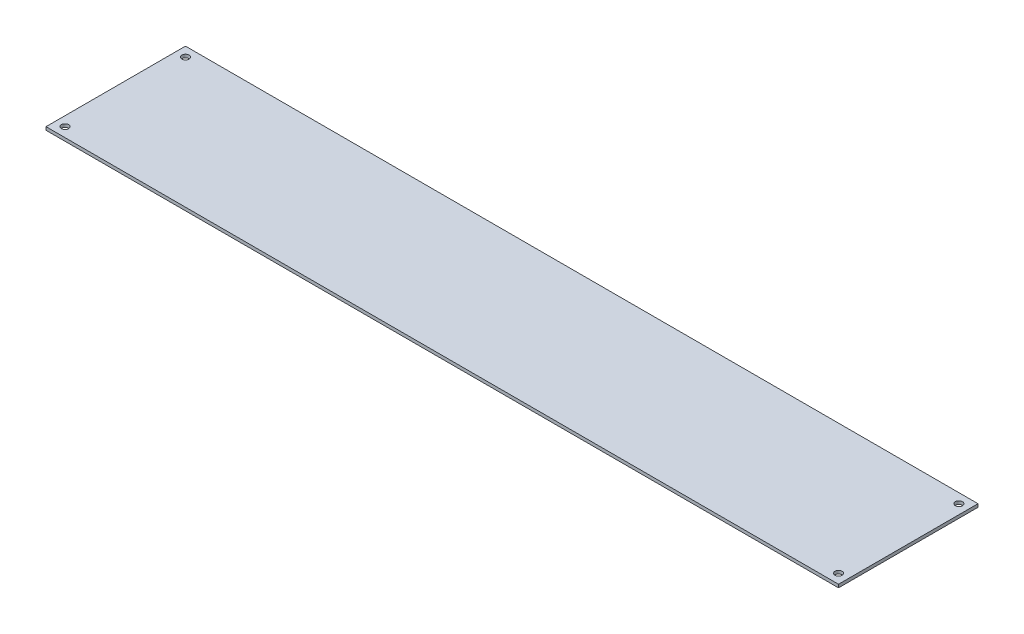
ISO-10303-21;
HEADER;
FILE_DESCRIPTION(('STEP AP214'),'2;1');
FILE_NAME('part.step','',(''),(''),'','','');
FILE_SCHEMA(('AUTOMOTIVE_DESIGN { 1 0 10303 214 1 1 1 1 }'));
ENDSEC;
DATA;
#1=APPLICATION_CONTEXT('core data for automotive mechanical design processes');
#2=APPLICATION_PROTOCOL_DEFINITION('international standard','automotive_design',2000,#1);
#3=PRODUCT_CONTEXT('',#1,'mechanical');
#4=PRODUCT('Part','Part','',(#3));
#5=PRODUCT_RELATED_PRODUCT_CATEGORY('part','',(#4));
#6=PRODUCT_DEFINITION_FORMATION('','',#4);
#7=PRODUCT_DEFINITION_CONTEXT('part definition',#1,'design');
#8=PRODUCT_DEFINITION('design','',#6,#7);
#9=PRODUCT_DEFINITION_SHAPE('','',#8);
#10=(LENGTH_UNIT() NAMED_UNIT(*) SI_UNIT(.MILLI.,.METRE.));
#11=(NAMED_UNIT(*) PLANE_ANGLE_UNIT() SI_UNIT($,.RADIAN.));
#12=(NAMED_UNIT(*) SI_UNIT($,.STERADIAN.) SOLID_ANGLE_UNIT());
#13=UNCERTAINTY_MEASURE_WITH_UNIT(LENGTH_MEASURE(1.E-05),#10,'distance_accuracy_value','');
#14=(GEOMETRIC_REPRESENTATION_CONTEXT(3) GLOBAL_UNCERTAINTY_ASSIGNED_CONTEXT((#13)) GLOBAL_UNIT_ASSIGNED_CONTEXT((#10,
#11,#12)) REPRESENTATION_CONTEXT('',''));
#15=CARTESIAN_POINT('',(0.,0.,0.));
#16=DIRECTION('',(0.,0.,1.));
#17=DIRECTION('',(1.,0.,0.));
#18=AXIS2_PLACEMENT_3D('',#15,#16,#17);
#19=CARTESIAN_POINT('',(0.,2.,0.));
#20=DIRECTION('',(0.,-1.,0.));
#21=DIRECTION('',(0.,0.,-1.));
#22=AXIS2_PLACEMENT_3D('',#19,#20,#21);
#23=PLANE('',#22);
#24=CARTESIAN_POINT('',(494.,2.,-6.));
#25=DIRECTION('',(0.,1.,0.));
#26=DIRECTION('',(0.,0.,1.));
#27=AXIS2_PLACEMENT_3D('',#24,#25,#26);
#28=CIRCLE('',#27,2.24999999999997);
#29=CARTESIAN_POINT('',(494.,2.,-3.75000000000003));
#30=VERTEX_POINT('',#29);
#31=EDGE_CURVE('E118',#30,#30,#28,.T.);
#32=ORIENTED_EDGE('',*,*,#31,.F.);
#33=EDGE_LOOP('',(#32));
#34=FACE_BOUND('',#33,.T.);
#35=DIRECTION('',(0.,0.,1.));
#36=VECTOR('',#35,1.);
#37=CARTESIAN_POINT('',(0.,2.,0.));
#38=LINE('',#37,#36);
#39=CARTESIAN_POINT('',(0.,2.,-88.));
#40=VERTEX_POINT('',#39);
#41=CARTESIAN_POINT('',(0.,2.,0.));
#42=VERTEX_POINT('',#41);
#43=EDGE_CURVE('E84',#40,#42,#38,.T.);
#44=ORIENTED_EDGE('',*,*,#43,.T.);
#45=DIRECTION('',(1.,0.,0.));
#46=VECTOR('',#45,1.);
#47=CARTESIAN_POINT('',(0.,2.,0.));
#48=LINE('',#47,#46);
#49=CARTESIAN_POINT('',(500.,2.,0.));
#50=VERTEX_POINT('',#49);
#51=EDGE_CURVE('E79',#42,#50,#48,.T.);
#52=ORIENTED_EDGE('',*,*,#51,.T.);
#53=DIRECTION('',(0.,0.,-1.));
#54=VECTOR('',#53,1.);
#55=CARTESIAN_POINT('',(500.,2.,0.));
#56=LINE('',#55,#54);
#57=CARTESIAN_POINT('',(500.,2.,-88.));
#58=VERTEX_POINT('',#57);
#59=EDGE_CURVE('E82',#50,#58,#56,.T.);
#60=ORIENTED_EDGE('',*,*,#59,.T.);
#61=DIRECTION('',(-1.,0.,0.));
#62=VECTOR('',#61,1.);
#63=CARTESIAN_POINT('',(0.,2.,-88.));
#64=LINE('',#63,#62);
#65=EDGE_CURVE('E49',#58,#40,#64,.T.);
#66=ORIENTED_EDGE('',*,*,#65,.T.);
#67=EDGE_LOOP('',(#44,#52,#60,#66));
#68=FACE_BOUND('',#67,.T.);
#69=CARTESIAN_POINT('',(494.,2.,-82.));
#70=DIRECTION('',(0.,1.,0.));
#71=DIRECTION('',(0.,0.,1.));
#72=AXIS2_PLACEMENT_3D('',#69,#70,#71);
#73=CIRCLE('',#72,2.24999999999997);
#74=CARTESIAN_POINT('',(494.,2.,-79.75));
#75=VERTEX_POINT('',#74);
#76=EDGE_CURVE('E112',#75,#75,#73,.T.);
#77=ORIENTED_EDGE('',*,*,#76,.F.);
#78=EDGE_LOOP('',(#77));
#79=FACE_BOUND('',#78,.T.);
#80=CARTESIAN_POINT('',(6.00000000000001,2.,-6.));
#81=DIRECTION('',(0.,1.,0.));
#82=DIRECTION('',(0.,0.,1.));
#83=AXIS2_PLACEMENT_3D('',#80,#81,#82);
#84=CIRCLE('',#83,2.24999999999999);
#85=CARTESIAN_POINT('',(6.00000000000001,2.,-3.75000000000001));
#86=VERTEX_POINT('',#85);
#87=EDGE_CURVE('E124',#86,#86,#84,.T.);
#88=ORIENTED_EDGE('',*,*,#87,.F.);
#89=EDGE_LOOP('',(#88));
#90=FACE_BOUND('',#89,.T.);
#91=CARTESIAN_POINT('',(6.00000000000001,2.,-82.));
#92=DIRECTION('',(0.,1.,0.));
#93=DIRECTION('',(0.,0.,1.));
#94=AXIS2_PLACEMENT_3D('',#91,#92,#93);
#95=CIRCLE('',#94,2.24999999999999);
#96=CARTESIAN_POINT('',(6.00000000000001,2.,-79.75));
#97=VERTEX_POINT('',#96);
#98=EDGE_CURVE('E130',#97,#97,#95,.T.);
#99=ORIENTED_EDGE('',*,*,#98,.F.);
#100=EDGE_LOOP('',(#99));
#101=FACE_BOUND('',#100,.T.);
#102=ADVANCED_FACE('F32',(#34,#68,#79,#90,#101),#23,.F.);
#103=CARTESIAN_POINT('',(0.,2.,0.));
#104=DIRECTION('',(1.,0.,0.));
#105=DIRECTION('',(0.,0.,-1.));
#106=AXIS2_PLACEMENT_3D('',#103,#104,#105);
#107=PLANE('',#106);
#108=DIRECTION('',(0.,0.,1.));
#109=VECTOR('',#108,1.);
#110=CARTESIAN_POINT('',(0.,0.,0.));
#111=LINE('',#110,#109);
#112=CARTESIAN_POINT('',(0.,0.,-88.));
#113=VERTEX_POINT('',#112);
#114=CARTESIAN_POINT('',(0.,0.,0.));
#115=VERTEX_POINT('',#114);
#116=EDGE_CURVE('E96',#113,#115,#111,.T.);
#117=ORIENTED_EDGE('',*,*,#116,.T.);
#118=DIRECTION('',(0.,-1.,0.));
#119=VECTOR('',#118,1.);
#120=CARTESIAN_POINT('',(0.,2.,0.));
#121=LINE('',#120,#119);
#122=EDGE_CURVE('E11',#42,#115,#121,.T.);
#123=ORIENTED_EDGE('',*,*,#122,.F.);
#124=ORIENTED_EDGE('',*,*,#43,.F.);
#125=DIRECTION('',(0.,-1.,0.));
#126=VECTOR('',#125,1.);
#127=CARTESIAN_POINT('',(0.,2.,-88.));
#128=LINE('',#127,#126);
#129=EDGE_CURVE('E92',#40,#113,#128,.T.);
#130=ORIENTED_EDGE('',*,*,#129,.T.);
#131=EDGE_LOOP('',(#117,#123,#124,#130));
#132=FACE_BOUND('',#131,.T.);
#133=ADVANCED_FACE('F34',(#132),#107,.F.);
#134=CARTESIAN_POINT('',(0.,2.,0.));
#135=DIRECTION('',(0.,0.,-1.));
#136=DIRECTION('',(-1.,0.,0.));
#137=AXIS2_PLACEMENT_3D('',#134,#135,#136);
#138=PLANE('',#137);
#139=DIRECTION('',(1.,0.,0.));
#140=VECTOR('',#139,1.);
#141=CARTESIAN_POINT('',(0.,0.,0.));
#142=LINE('',#141,#140);
#143=CARTESIAN_POINT('',(500.,0.,0.));
#144=VERTEX_POINT('',#143);
#145=EDGE_CURVE('E88',#115,#144,#142,.T.);
#146=ORIENTED_EDGE('',*,*,#145,.T.);
#147=DIRECTION('',(0.,-1.,0.));
#148=VECTOR('',#147,1.);
#149=CARTESIAN_POINT('',(500.,2.,0.));
#150=LINE('',#149,#148);
#151=EDGE_CURVE('E41',#50,#144,#150,.T.);
#152=ORIENTED_EDGE('',*,*,#151,.F.);
#153=ORIENTED_EDGE('',*,*,#51,.F.);
#154=ORIENTED_EDGE('',*,*,#122,.T.);
#155=EDGE_LOOP('',(#146,#152,#153,#154));
#156=FACE_BOUND('',#155,.T.);
#157=ADVANCED_FACE('F87',(#156),#138,.F.);
#158=CARTESIAN_POINT('',(500.,2.,0.));
#159=DIRECTION('',(-1.,0.,0.));
#160=DIRECTION('',(0.,0.,1.));
#161=AXIS2_PLACEMENT_3D('',#158,#159,#160);
#162=PLANE('',#161);
#163=DIRECTION('',(0.,0.,-1.));
#164=VECTOR('',#163,1.);
#165=CARTESIAN_POINT('',(500.,0.,0.));
#166=LINE('',#165,#164);
#167=CARTESIAN_POINT('',(500.,0.,-88.));
#168=VERTEX_POINT('',#167);
#169=EDGE_CURVE('E66',#144,#168,#166,.T.);
#170=ORIENTED_EDGE('',*,*,#169,.T.);
#171=DIRECTION('',(0.,-1.,0.));
#172=VECTOR('',#171,1.);
#173=CARTESIAN_POINT('',(500.,2.,-88.));
#174=LINE('',#173,#172);
#175=EDGE_CURVE('E89',#58,#168,#174,.T.);
#176=ORIENTED_EDGE('',*,*,#175,.F.);
#177=ORIENTED_EDGE('',*,*,#59,.F.);
#178=ORIENTED_EDGE('',*,*,#151,.T.);
#179=EDGE_LOOP('',(#170,#176,#177,#178));
#180=FACE_BOUND('',#179,.T.);
#181=ADVANCED_FACE('F90',(#180),#162,.F.);
#182=CARTESIAN_POINT('',(0.,2.,-88.));
#183=DIRECTION('',(0.,0.,1.));
#184=DIRECTION('',(1.,0.,0.));
#185=AXIS2_PLACEMENT_3D('',#182,#183,#184);
#186=PLANE('',#185);
#187=DIRECTION('',(-1.,0.,0.));
#188=VECTOR('',#187,1.);
#189=CARTESIAN_POINT('',(0.,0.,-88.));
#190=LINE('',#189,#188);
#191=EDGE_CURVE('E72',#168,#113,#190,.T.);
#192=ORIENTED_EDGE('',*,*,#191,.T.);
#193=ORIENTED_EDGE('',*,*,#129,.F.);
#194=ORIENTED_EDGE('',*,*,#65,.F.);
#195=ORIENTED_EDGE('',*,*,#175,.T.);
#196=EDGE_LOOP('',(#192,#193,#194,#195));
#197=FACE_BOUND('',#196,.T.);
#198=ADVANCED_FACE('F104',(#197),#186,.F.);
#199=CARTESIAN_POINT('',(0.,0.,0.));
#200=DIRECTION('',(0.,-1.,0.));
#201=DIRECTION('',(0.,0.,-1.));
#202=AXIS2_PLACEMENT_3D('',#199,#200,#201);
#203=PLANE('',#202);
#204=CARTESIAN_POINT('',(6.00000000000001,0.,-82.));
#205=DIRECTION('',(0.,-1.,0.));
#206=DIRECTION('',(0.,0.,-1.));
#207=AXIS2_PLACEMENT_3D('',#204,#205,#206);
#208=CIRCLE('',#207,2.24999999999999);
#209=CARTESIAN_POINT('',(6.00000000000001,0.,-84.25));
#210=VERTEX_POINT('',#209);
#211=EDGE_CURVE('E127',#210,#210,#208,.T.);
#212=ORIENTED_EDGE('',*,*,#211,.F.);
#213=EDGE_LOOP('',(#212));
#214=FACE_BOUND('',#213,.T.);
#215=CARTESIAN_POINT('',(6.00000000000001,0.,-6.));
#216=DIRECTION('',(0.,-1.,0.));
#217=DIRECTION('',(0.,0.,-1.));
#218=AXIS2_PLACEMENT_3D('',#215,#216,#217);
#219=CIRCLE('',#218,2.24999999999999);
#220=CARTESIAN_POINT('',(6.00000000000001,0.,-8.24999999999999));
#221=VERTEX_POINT('',#220);
#222=EDGE_CURVE('E121',#221,#221,#219,.T.);
#223=ORIENTED_EDGE('',*,*,#222,.F.);
#224=EDGE_LOOP('',(#223));
#225=FACE_BOUND('',#224,.T.);
#226=CARTESIAN_POINT('',(494.,0.,-6.));
#227=DIRECTION('',(0.,-1.,0.));
#228=DIRECTION('',(0.,0.,-1.));
#229=AXIS2_PLACEMENT_3D('',#226,#227,#228);
#230=CIRCLE('',#229,2.24999999999997);
#231=CARTESIAN_POINT('',(494.,0.,-8.24999999999998));
#232=VERTEX_POINT('',#231);
#233=EDGE_CURVE('E115',#232,#232,#230,.T.);
#234=ORIENTED_EDGE('',*,*,#233,.F.);
#235=EDGE_LOOP('',(#234));
#236=FACE_BOUND('',#235,.T.);
#237=CARTESIAN_POINT('',(494.,0.,-82.));
#238=DIRECTION('',(0.,-1.,0.));
#239=DIRECTION('',(0.,0.,-1.));
#240=AXIS2_PLACEMENT_3D('',#237,#238,#239);
#241=CIRCLE('',#240,2.24999999999997);
#242=CARTESIAN_POINT('',(494.,0.,-84.25));
#243=VERTEX_POINT('',#242);
#244=EDGE_CURVE('E99',#243,#243,#241,.T.);
#245=ORIENTED_EDGE('',*,*,#244,.F.);
#246=EDGE_LOOP('',(#245));
#247=FACE_BOUND('',#246,.T.);
#248=ORIENTED_EDGE('',*,*,#116,.F.);
#249=ORIENTED_EDGE('',*,*,#191,.F.);
#250=ORIENTED_EDGE('',*,*,#169,.F.);
#251=ORIENTED_EDGE('',*,*,#145,.F.);
#252=EDGE_LOOP('',(#248,#249,#250,#251));
#253=FACE_BOUND('',#252,.T.);
#254=ADVANCED_FACE('F107',(#214,#225,#236,#247,#253),#203,.T.);
#255=CARTESIAN_POINT('',(494.,2.,-82.));
#256=DIRECTION('',(0.,1.,0.));
#257=DIRECTION('',(0.,0.,1.));
#258=AXIS2_PLACEMENT_3D('',#255,#256,#257);
#259=CYLINDRICAL_SURFACE('',#258,2.24999999999997);
#260=ORIENTED_EDGE('',*,*,#76,.T.);
#261=EDGE_LOOP('',(#260));
#262=FACE_BOUND('',#261,.T.);
#263=ORIENTED_EDGE('',*,*,#244,.T.);
#264=EDGE_LOOP('',(#263));
#265=FACE_BOUND('',#264,.T.);
#266=ADVANCED_FACE('F146',(#262,#265),#259,.F.);
#267=CARTESIAN_POINT('',(494.,2.,-6.));
#268=DIRECTION('',(0.,1.,0.));
#269=DIRECTION('',(0.,0.,1.));
#270=AXIS2_PLACEMENT_3D('',#267,#268,#269);
#271=CYLINDRICAL_SURFACE('',#270,2.24999999999997);
#272=ORIENTED_EDGE('',*,*,#31,.T.);
#273=EDGE_LOOP('',(#272));
#274=FACE_BOUND('',#273,.T.);
#275=ORIENTED_EDGE('',*,*,#233,.T.);
#276=EDGE_LOOP('',(#275));
#277=FACE_BOUND('',#276,.T.);
#278=ADVANCED_FACE('F177',(#274,#277),#271,.F.);
#279=CARTESIAN_POINT('',(6.00000000000001,2.,-6.));
#280=DIRECTION('',(0.,1.,0.));
#281=DIRECTION('',(0.,0.,1.));
#282=AXIS2_PLACEMENT_3D('',#279,#280,#281);
#283=CYLINDRICAL_SURFACE('',#282,2.24999999999999);
#284=ORIENTED_EDGE('',*,*,#87,.T.);
#285=EDGE_LOOP('',(#284));
#286=FACE_BOUND('',#285,.T.);
#287=ORIENTED_EDGE('',*,*,#222,.T.);
#288=EDGE_LOOP('',(#287));
#289=FACE_BOUND('',#288,.T.);
#290=ADVANCED_FACE('F184',(#286,#289),#283,.F.);
#291=CARTESIAN_POINT('',(6.00000000000001,2.,-82.));
#292=DIRECTION('',(0.,1.,0.));
#293=DIRECTION('',(0.,0.,1.));
#294=AXIS2_PLACEMENT_3D('',#291,#292,#293);
#295=CYLINDRICAL_SURFACE('',#294,2.24999999999999);
#296=ORIENTED_EDGE('',*,*,#98,.T.);
#297=EDGE_LOOP('',(#296));
#298=FACE_BOUND('',#297,.T.);
#299=ORIENTED_EDGE('',*,*,#211,.T.);
#300=EDGE_LOOP('',(#299));
#301=FACE_BOUND('',#300,.T.);
#302=ADVANCED_FACE('F134',(#298,#301),#295,.F.);
#303=CLOSED_SHELL('',(#102,#133,#157,#181,#198,#254,#266,#278,#290,#302));
#304=MANIFOLD_SOLID_BREP('B2',#303);
#305=ADVANCED_BREP_SHAPE_REPRESENTATION('',(#18,#304),#14);
#306=SHAPE_DEFINITION_REPRESENTATION(#9,#305);
ENDSEC;
END-ISO-10303-21;
